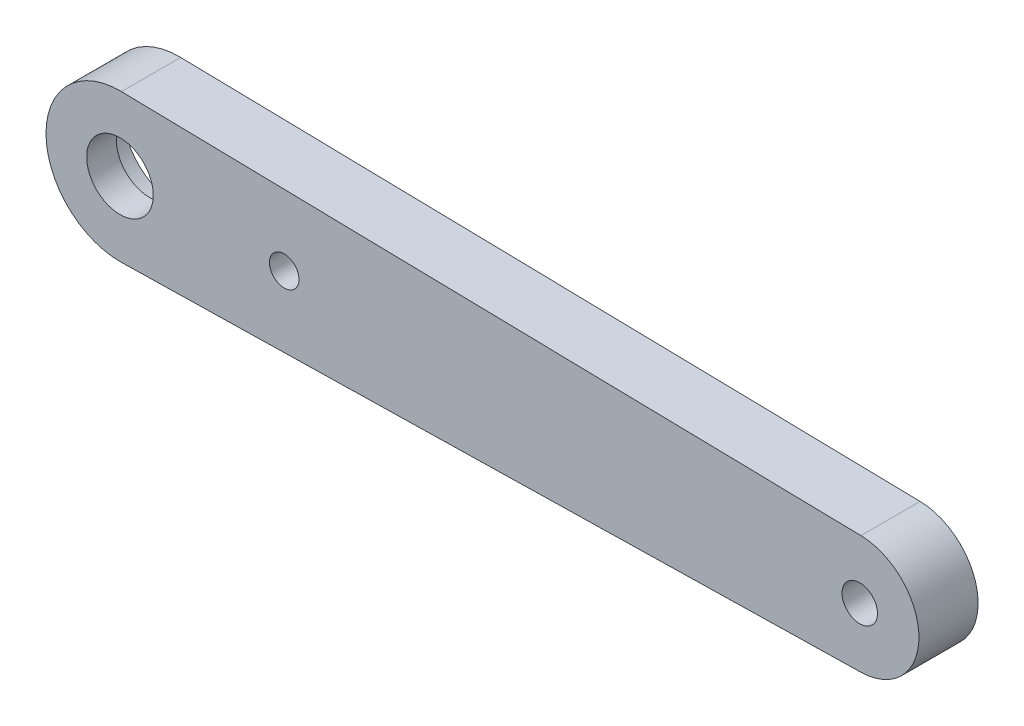
ISO-10303-21;
HEADER;
FILE_DESCRIPTION(('STEP AP214'),'2;1');
FILE_NAME('part.step','',(''),(''),'','','');
FILE_SCHEMA(('AUTOMOTIVE_DESIGN { 1 0 10303 214 1 1 1 1 }'));
ENDSEC;
DATA;
#1=APPLICATION_CONTEXT('core data for automotive mechanical design processes');
#2=APPLICATION_PROTOCOL_DEFINITION('international standard','automotive_design',2000,#1);
#3=PRODUCT_CONTEXT('',#1,'mechanical');
#4=PRODUCT('Part','Part','',(#3));
#5=PRODUCT_RELATED_PRODUCT_CATEGORY('part','',(#4));
#6=PRODUCT_DEFINITION_FORMATION('','',#4);
#7=PRODUCT_DEFINITION_CONTEXT('part definition',#1,'design');
#8=PRODUCT_DEFINITION('design','',#6,#7);
#9=PRODUCT_DEFINITION_SHAPE('','',#8);
#10=(LENGTH_UNIT() NAMED_UNIT(*) SI_UNIT(.MILLI.,.METRE.));
#11=(NAMED_UNIT(*) PLANE_ANGLE_UNIT() SI_UNIT($,.RADIAN.));
#12=(NAMED_UNIT(*) SI_UNIT($,.STERADIAN.) SOLID_ANGLE_UNIT());
#13=UNCERTAINTY_MEASURE_WITH_UNIT(LENGTH_MEASURE(1.E-05),#10,'distance_accuracy_value','');
#14=(GEOMETRIC_REPRESENTATION_CONTEXT(3) GLOBAL_UNCERTAINTY_ASSIGNED_CONTEXT((#13)) GLOBAL_UNIT_ASSIGNED_CONTEXT((#10,
#11,#12)) REPRESENTATION_CONTEXT('',''));
#15=CARTESIAN_POINT('',(0.,0.,0.));
#16=DIRECTION('',(0.,0.,1.));
#17=DIRECTION('',(1.,0.,0.));
#18=AXIS2_PLACEMENT_3D('',#15,#16,#17);
#19=CARTESIAN_POINT('',(0.1,-4.99899989998,4.));
#20=DIRECTION('',(-0.02,0.999799979995999,0.));
#21=DIRECTION('',(-0.999799979995999,-0.02,0.));
#22=AXIS2_PLACEMENT_3D('',#19,#20,#21);
#23=PLANE('',#22);
#24=DIRECTION('',(0.999799979995999,0.02,0.));
#25=VECTOR('',#24,1.);
#26=CARTESIAN_POINT('',(0.1,-4.99899989998,0.));
#27=LINE('',#26,#25);
#28=CARTESIAN_POINT('',(0.1,-4.99899989998,0.));
#29=VERTEX_POINT('',#28);
#30=CARTESIAN_POINT('',(50.08,-3.999199919984,0.));
#31=VERTEX_POINT('',#30);
#32=EDGE_CURVE('E186',#29,#31,#27,.T.);
#33=ORIENTED_EDGE('',*,*,#32,.T.);
#34=DIRECTION('',(0.,0.,-1.));
#35=VECTOR('',#34,1.);
#36=CARTESIAN_POINT('',(50.08,-3.999199919984,4.));
#37=LINE('',#36,#35);
#38=CARTESIAN_POINT('',(50.08,-3.999199919984,4.));
#39=VERTEX_POINT('',#38);
#40=EDGE_CURVE('E11',#39,#31,#37,.T.);
#41=ORIENTED_EDGE('',*,*,#40,.F.);
#42=DIRECTION('',(0.999799979995999,0.02,0.));
#43=VECTOR('',#42,1.);
#44=CARTESIAN_POINT('',(0.1,-4.99899989998,4.));
#45=LINE('',#44,#43);
#46=CARTESIAN_POINT('',(0.1,-4.99899989998,4.));
#47=VERTEX_POINT('',#46);
#48=EDGE_CURVE('E187',#47,#39,#45,.T.);
#49=ORIENTED_EDGE('',*,*,#48,.F.);
#50=DIRECTION('',(0.,0.,-1.));
#51=VECTOR('',#50,1.);
#52=CARTESIAN_POINT('',(0.1,-4.99899989998,4.));
#53=LINE('',#52,#51);
#54=EDGE_CURVE('E198',#47,#29,#53,.T.);
#55=ORIENTED_EDGE('',*,*,#54,.T.);
#56=EDGE_LOOP('',(#33,#41,#49,#55));
#57=FACE_BOUND('',#56,.T.);
#58=ADVANCED_FACE('F41',(#57),#23,.F.);
#59=CARTESIAN_POINT('',(50.,0.,4.));
#60=DIRECTION('',(0.,0.,-1.));
#61=DIRECTION('',(-1.,0.,0.));
#62=AXIS2_PLACEMENT_3D('',#59,#60,#61);
#63=CYLINDRICAL_SURFACE('',#62,4.00000000000001);
#64=CARTESIAN_POINT('',(50.,0.,0.));
#65=DIRECTION('',(0.,0.,1.));
#66=DIRECTION('',(1.,0.,0.));
#67=AXIS2_PLACEMENT_3D('',#64,#65,#66);
#68=CIRCLE('',#67,4.00000000000001);
#69=CARTESIAN_POINT('',(50.08,3.999199919984,0.));
#70=VERTEX_POINT('',#69);
#71=EDGE_CURVE('E201',#31,#70,#68,.T.);
#72=ORIENTED_EDGE('',*,*,#71,.T.);
#73=DIRECTION('',(0.,0.,-1.));
#74=VECTOR('',#73,1.);
#75=CARTESIAN_POINT('',(50.08,3.999199919984,4.));
#76=LINE('',#75,#74);
#77=CARTESIAN_POINT('',(50.08,3.999199919984,4.));
#78=VERTEX_POINT('',#77);
#79=EDGE_CURVE('E49',#78,#70,#76,.T.);
#80=ORIENTED_EDGE('',*,*,#79,.F.);
#81=CARTESIAN_POINT('',(50.,0.,4.));
#82=DIRECTION('',(0.,0.,1.));
#83=DIRECTION('',(1.,0.,0.));
#84=AXIS2_PLACEMENT_3D('',#81,#82,#83);
#85=CIRCLE('',#84,4.00000000000001);
#86=EDGE_CURVE('E93',#39,#78,#85,.T.);
#87=ORIENTED_EDGE('',*,*,#86,.F.);
#88=ORIENTED_EDGE('',*,*,#40,.T.);
#89=EDGE_LOOP('',(#72,#80,#87,#88));
#90=FACE_BOUND('',#89,.T.);
#91=ADVANCED_FACE('F216',(#90),#63,.T.);
#92=CARTESIAN_POINT('',(0.1,4.99899989998,4.));
#93=DIRECTION('',(0.02,0.999799979995999,0.));
#94=DIRECTION('',(-0.999799979995999,0.02,0.));
#95=AXIS2_PLACEMENT_3D('',#92,#93,#94);
#96=PLANE('',#95);
#97=DIRECTION('',(0.999799979995999,-0.02,0.));
#98=VECTOR('',#97,1.);
#99=CARTESIAN_POINT('',(0.1,4.99899989998,0.));
#100=LINE('',#99,#98);
#101=CARTESIAN_POINT('',(0.0999999999999983,4.99899989998,0.));
#102=VERTEX_POINT('',#101);
#103=EDGE_CURVE('E204',#102,#70,#100,.T.);
#104=ORIENTED_EDGE('',*,*,#103,.F.);
#105=DIRECTION('',(0.,0.,-1.));
#106=VECTOR('',#105,1.);
#107=CARTESIAN_POINT('',(0.0999999999999983,4.99899989998,4.));
#108=LINE('',#107,#106);
#109=CARTESIAN_POINT('',(0.0999999999999983,4.99899989998,4.));
#110=VERTEX_POINT('',#109);
#111=EDGE_CURVE('E211',#110,#102,#108,.T.);
#112=ORIENTED_EDGE('',*,*,#111,.F.);
#113=DIRECTION('',(0.999799979995999,-0.02,0.));
#114=VECTOR('',#113,1.);
#115=CARTESIAN_POINT('',(0.1,4.99899989998,4.));
#116=LINE('',#115,#114);
#117=EDGE_CURVE('E191',#110,#78,#116,.T.);
#118=ORIENTED_EDGE('',*,*,#117,.T.);
#119=ORIENTED_EDGE('',*,*,#79,.T.);
#120=EDGE_LOOP('',(#104,#112,#118,#119));
#121=FACE_BOUND('',#120,.T.);
#122=ADVANCED_FACE('F215',(#121),#96,.T.);
#123=CARTESIAN_POINT('',(0.,0.,4.));
#124=DIRECTION('',(0.,0.,-1.));
#125=DIRECTION('',(-1.,0.,0.));
#126=AXIS2_PLACEMENT_3D('',#123,#124,#125);
#127=CYLINDRICAL_SURFACE('',#126,5.);
#128=CARTESIAN_POINT('',(0.,0.,0.));
#129=DIRECTION('',(0.,0.,1.));
#130=DIRECTION('',(1.,0.,0.));
#131=AXIS2_PLACEMENT_3D('',#128,#129,#130);
#132=CIRCLE('',#131,5.);
#133=EDGE_CURVE('E86',#102,#29,#132,.T.);
#134=ORIENTED_EDGE('',*,*,#133,.T.);
#135=ORIENTED_EDGE('',*,*,#54,.F.);
#136=CARTESIAN_POINT('',(0.,0.,4.));
#137=DIRECTION('',(0.,0.,1.));
#138=DIRECTION('',(1.,0.,0.));
#139=AXIS2_PLACEMENT_3D('',#136,#137,#138);
#140=CIRCLE('',#139,5.);
#141=EDGE_CURVE('E65',#110,#47,#140,.T.);
#142=ORIENTED_EDGE('',*,*,#141,.F.);
#143=ORIENTED_EDGE('',*,*,#111,.T.);
#144=EDGE_LOOP('',(#134,#135,#142,#143));
#145=FACE_BOUND('',#144,.T.);
#146=ADVANCED_FACE('F224',(#145),#127,.T.);
#147=CARTESIAN_POINT('',(50.,0.,4.));
#148=DIRECTION('',(0.,0.,-1.));
#149=DIRECTION('',(-1.,0.,0.));
#150=AXIS2_PLACEMENT_3D('',#147,#148,#149);
#151=CYLINDRICAL_SURFACE('',#150,1.2);
#152=CARTESIAN_POINT('',(50.,0.,4.));
#153=DIRECTION('',(0.,0.,1.));
#154=DIRECTION('',(1.,0.,0.));
#155=AXIS2_PLACEMENT_3D('',#152,#153,#154);
#156=CIRCLE('',#155,1.2);
#157=CARTESIAN_POINT('',(51.2,0.,4.));
#158=VERTEX_POINT('',#157);
#159=EDGE_CURVE('E195',#158,#158,#156,.T.);
#160=ORIENTED_EDGE('',*,*,#159,.T.);
#161=EDGE_LOOP('',(#160));
#162=FACE_BOUND('',#161,.T.);
#163=CARTESIAN_POINT('',(50.,0.,0.));
#164=DIRECTION('',(0.,0.,1.));
#165=DIRECTION('',(1.,0.,0.));
#166=AXIS2_PLACEMENT_3D('',#163,#164,#165);
#167=CIRCLE('',#166,1.2);
#168=CARTESIAN_POINT('',(51.2,0.,0.));
#169=VERTEX_POINT('',#168);
#170=EDGE_CURVE('E189',#169,#169,#167,.T.);
#171=ORIENTED_EDGE('',*,*,#170,.F.);
#172=EDGE_LOOP('',(#171));
#173=FACE_BOUND('',#172,.T.);
#174=ADVANCED_FACE('F228',(#162,#173),#151,.F.);
#175=CARTESIAN_POINT('',(0.,0.,4.));
#176=DIRECTION('',(0.,0.,1.));
#177=DIRECTION('',(1.,0.,0.));
#178=AXIS2_PLACEMENT_3D('',#175,#176,#177);
#179=PLANE('',#178);
#180=CARTESIAN_POINT('',(-3.0739299994309E-12,1.05644659686988E-12,4.));
#181=DIRECTION('',(0.,0.,1.));
#182=DIRECTION('',(1.,0.,0.));
#183=AXIS2_PLACEMENT_3D('',#180,#181,#182);
#184=CIRCLE('',#183,2.25000000000266);
#185=CARTESIAN_POINT('',(2.24999999999959,1.05644659686988E-12,4.));
#186=VERTEX_POINT('',#185);
#187=EDGE_CURVE('E452',#186,#186,#184,.T.);
#188=ORIENTED_EDGE('',*,*,#187,.F.);
#189=EDGE_LOOP('',(#188));
#190=FACE_BOUND('',#189,.T.);
#191=CARTESIAN_POINT('',(11.1,0.,4.));
#192=DIRECTION('',(0.,0.,1.));
#193=DIRECTION('',(1.,0.,0.));
#194=AXIS2_PLACEMENT_3D('',#191,#192,#193);
#195=CIRCLE('',#194,1.);
#196=CARTESIAN_POINT('',(12.1,0.,4.));
#197=VERTEX_POINT('',#196);
#198=EDGE_CURVE('E158',#197,#197,#195,.T.);
#199=ORIENTED_EDGE('',*,*,#198,.F.);
#200=EDGE_LOOP('',(#199));
#201=FACE_BOUND('',#200,.T.);
#202=ORIENTED_EDGE('',*,*,#48,.T.);
#203=ORIENTED_EDGE('',*,*,#86,.T.);
#204=ORIENTED_EDGE('',*,*,#117,.F.);
#205=ORIENTED_EDGE('',*,*,#141,.T.);
#206=EDGE_LOOP('',(#202,#203,#204,#205));
#207=FACE_BOUND('',#206,.T.);
#208=ORIENTED_EDGE('',*,*,#159,.F.);
#209=EDGE_LOOP('',(#208));
#210=FACE_BOUND('',#209,.T.);
#211=ADVANCED_FACE('F225',(#190,#201,#207,#210),#179,.T.);
#212=CARTESIAN_POINT('',(0.,0.,0.));
#213=DIRECTION('',(0.,0.,1.));
#214=DIRECTION('',(1.,0.,0.));
#215=AXIS2_PLACEMENT_3D('',#212,#213,#214);
#216=PLANE('',#215);
#217=CARTESIAN_POINT('',(0.,0.,0.));
#218=DIRECTION('',(0.,0.,1.));
#219=DIRECTION('',(1.,0.,0.));
#220=AXIS2_PLACEMENT_3D('',#217,#218,#219);
#221=CIRCLE('',#220,3.85);
#222=CARTESIAN_POINT('',(0.363207547169811,-3.83282927844157,0.));
#223=VERTEX_POINT('',#222);
#224=CARTESIAN_POINT('',(0.363207547169811,3.83282927844157,0.));
#225=VERTEX_POINT('',#224);
#226=EDGE_CURVE('E180',#223,#225,#221,.F.);
#227=ORIENTED_EDGE('',*,*,#226,.F.);
#228=DIRECTION('',(-0.995540072322485,-0.0943396226415095,0.));
#229=VECTOR('',#228,1.);
#230=CARTESIAN_POINT('',(0.363207547169812,-3.83282927844157,0.));
#231=LINE('',#230,#229);
#232=CARTESIAN_POINT('',(16.1216981132075,-2.33951916995784,0.));
#233=VERTEX_POINT('',#232);
#234=EDGE_CURVE('E136',#233,#223,#231,.T.);
#235=ORIENTED_EDGE('',*,*,#234,.F.);
#236=CARTESIAN_POINT('',(15.9,0.,0.));
#237=DIRECTION('',(0.,0.,1.));
#238=DIRECTION('',(1.,0.,0.));
#239=AXIS2_PLACEMENT_3D('',#236,#237,#238);
#240=CIRCLE('',#239,2.35);
#241=CARTESIAN_POINT('',(16.1216981132075,2.33951916995784,0.));
#242=VERTEX_POINT('',#241);
#243=EDGE_CURVE('E182',#242,#233,#240,.F.);
#244=ORIENTED_EDGE('',*,*,#243,.F.);
#245=DIRECTION('',(-0.995540072322485,0.0943396226415095,0.));
#246=VECTOR('',#245,1.);
#247=CARTESIAN_POINT('',(0.363207547169812,3.83282927844157,0.));
#248=LINE('',#247,#246);
#249=EDGE_CURVE('E139',#242,#225,#248,.T.);
#250=ORIENTED_EDGE('',*,*,#249,.T.);
#251=EDGE_LOOP('',(#227,#235,#244,#250));
#252=FACE_BOUND('',#251,.T.);
#253=ORIENTED_EDGE('',*,*,#32,.F.);
#254=ORIENTED_EDGE('',*,*,#133,.F.);
#255=ORIENTED_EDGE('',*,*,#103,.T.);
#256=ORIENTED_EDGE('',*,*,#71,.F.);
#257=EDGE_LOOP('',(#253,#254,#255,#256));
#258=FACE_BOUND('',#257,.T.);
#259=ORIENTED_EDGE('',*,*,#170,.T.);
#260=EDGE_LOOP('',(#259));
#261=FACE_BOUND('',#260,.T.);
#262=ADVANCED_FACE('F220',(#252,#258,#261),#216,.F.);
#263=CARTESIAN_POINT('',(0.363207547169812,-3.83282927844157,-23.4029912618024));
#264=DIRECTION('',(0.0943396226415095,-0.995540072322485,0.));
#265=DIRECTION('',(0.995540072322485,0.0943396226415095,0.));
#266=AXIS2_PLACEMENT_3D('',#263,#264,#265);
#267=PLANE('',#266);
#268=ORIENTED_EDGE('',*,*,#234,.T.);
#269=DIRECTION('',(0.,0.,1.));
#270=VECTOR('',#269,1.);
#271=CARTESIAN_POINT('',(0.363207547169811,-3.83282927844157,-23.4029912618024));
#272=LINE('',#271,#270);
#273=CARTESIAN_POINT('',(0.363207547169812,-3.83282927844157,2.));
#274=VERTEX_POINT('',#273);
#275=EDGE_CURVE('E128',#223,#274,#272,.T.);
#276=ORIENTED_EDGE('',*,*,#275,.T.);
#277=DIRECTION('',(-0.995540072322485,-0.0943396226415095,0.));
#278=VECTOR('',#277,1.);
#279=CARTESIAN_POINT('',(0.363207547169812,-3.83282927844157,2.));
#280=LINE('',#279,#278);
#281=CARTESIAN_POINT('',(6.,-3.29867411212271,2.));
#282=VERTEX_POINT('',#281);
#283=EDGE_CURVE('E132',#282,#274,#280,.T.);
#284=ORIENTED_EDGE('',*,*,#283,.F.);
#285=DIRECTION('',(0.,0.,-1.));
#286=VECTOR('',#285,1.);
#287=CARTESIAN_POINT('',(6.,-3.29867411212271,2.));
#288=LINE('',#287,#286);
#289=CARTESIAN_POINT('',(6.,-3.29867411212271,1.5));
#290=VERTEX_POINT('',#289);
#291=EDGE_CURVE('E166',#282,#290,#288,.T.);
#292=ORIENTED_EDGE('',*,*,#291,.T.);
#293=DIRECTION('',(0.995540072322485,0.0943396226415095,0.));
#294=VECTOR('',#293,1.);
#295=CARTESIAN_POINT('',(0.363207547169812,-3.83282927844157,1.5));
#296=LINE('',#295,#294);
#297=CARTESIAN_POINT('',(16.1216981132075,-2.33951916995784,1.5));
#298=VERTEX_POINT('',#297);
#299=EDGE_CURVE('E173',#290,#298,#296,.T.);
#300=ORIENTED_EDGE('',*,*,#299,.T.);
#301=DIRECTION('',(0.,0.,1.));
#302=VECTOR('',#301,1.);
#303=CARTESIAN_POINT('',(16.1216981132075,-2.33951916995784,-23.4029912618024));
#304=LINE('',#303,#302);
#305=EDGE_CURVE('E140',#233,#298,#304,.T.);
#306=ORIENTED_EDGE('',*,*,#305,.F.);
#307=EDGE_LOOP('',(#268,#276,#284,#292,#300,#306));
#308=FACE_BOUND('',#307,.T.);
#309=ADVANCED_FACE('F130',(#308),#267,.F.);
#310=CARTESIAN_POINT('',(0.,0.,-23.4029912618024));
#311=DIRECTION('',(0.,0.,1.));
#312=DIRECTION('',(1.,0.,0.));
#313=AXIS2_PLACEMENT_3D('',#310,#311,#312);
#314=CYLINDRICAL_SURFACE('',#313,3.85);
#315=ORIENTED_EDGE('',*,*,#226,.T.);
#316=DIRECTION('',(0.,0.,1.));
#317=VECTOR('',#316,1.);
#318=CARTESIAN_POINT('',(0.363207547169811,3.83282927844157,-23.4029912618024));
#319=LINE('',#318,#317);
#320=CARTESIAN_POINT('',(0.363207547169811,3.83282927844157,2.));
#321=VERTEX_POINT('',#320);
#322=EDGE_CURVE('E146',#225,#321,#319,.T.);
#323=ORIENTED_EDGE('',*,*,#322,.T.);
#324=CARTESIAN_POINT('',(0.,0.,2.));
#325=DIRECTION('',(0.,0.,-1.));
#326=DIRECTION('',(-1.,0.,0.));
#327=AXIS2_PLACEMENT_3D('',#324,#325,#326);
#328=CIRCLE('',#327,3.85);
#329=EDGE_CURVE('E143',#274,#321,#328,.T.);
#330=ORIENTED_EDGE('',*,*,#329,.F.);
#331=ORIENTED_EDGE('',*,*,#275,.F.);
#332=EDGE_LOOP('',(#315,#323,#330,#331));
#333=FACE_BOUND('',#332,.T.);
#334=ADVANCED_FACE('F144',(#333),#314,.F.);
#335=CARTESIAN_POINT('',(0.363207547169812,3.83282927844157,-23.4029912618024));
#336=DIRECTION('',(-0.0943396226415095,-0.995540072322485,0.));
#337=DIRECTION('',(0.995540072322485,-0.0943396226415095,0.));
#338=AXIS2_PLACEMENT_3D('',#335,#336,#337);
#339=PLANE('',#338);
#340=DIRECTION('',(0.,0.,1.));
#341=VECTOR('',#340,1.);
#342=CARTESIAN_POINT('',(16.1216981132075,2.33951916995784,-23.4029912618024));
#343=LINE('',#342,#341);
#344=CARTESIAN_POINT('',(16.1216981132075,2.33951916995784,1.5));
#345=VERTEX_POINT('',#344);
#346=EDGE_CURVE('E56',#242,#345,#343,.T.);
#347=ORIENTED_EDGE('',*,*,#346,.T.);
#348=DIRECTION('',(0.995540072322485,-0.0943396226415095,0.));
#349=VECTOR('',#348,1.);
#350=CARTESIAN_POINT('',(0.363207547169812,3.83282927844157,1.5));
#351=LINE('',#350,#349);
#352=CARTESIAN_POINT('',(6.,3.2986741121227,1.5));
#353=VERTEX_POINT('',#352);
#354=EDGE_CURVE('E169',#353,#345,#351,.T.);
#355=ORIENTED_EDGE('',*,*,#354,.F.);
#356=DIRECTION('',(0.,0.,-1.));
#357=VECTOR('',#356,1.);
#358=CARTESIAN_POINT('',(6.,3.2986741121227,2.));
#359=LINE('',#358,#357);
#360=CARTESIAN_POINT('',(6.,3.2986741121227,2.));
#361=VERTEX_POINT('',#360);
#362=EDGE_CURVE('E164',#361,#353,#359,.T.);
#363=ORIENTED_EDGE('',*,*,#362,.F.);
#364=DIRECTION('',(0.995540072322485,-0.0943396226415095,0.));
#365=VECTOR('',#364,1.);
#366=CARTESIAN_POINT('',(0.363207547169812,3.83282927844157,2.));
#367=LINE('',#366,#365);
#368=EDGE_CURVE('E150',#321,#361,#367,.T.);
#369=ORIENTED_EDGE('',*,*,#368,.F.);
#370=ORIENTED_EDGE('',*,*,#322,.F.);
#371=ORIENTED_EDGE('',*,*,#249,.F.);
#372=EDGE_LOOP('',(#347,#355,#363,#369,#370,#371));
#373=FACE_BOUND('',#372,.T.);
#374=ADVANCED_FACE('F316',(#373),#339,.T.);
#375=CARTESIAN_POINT('',(15.9,0.,-23.4029912618024));
#376=DIRECTION('',(0.,0.,1.));
#377=DIRECTION('',(1.,0.,0.));
#378=AXIS2_PLACEMENT_3D('',#375,#376,#377);
#379=CYLINDRICAL_SURFACE('',#378,2.35);
#380=ORIENTED_EDGE('',*,*,#243,.T.);
#381=ORIENTED_EDGE('',*,*,#305,.T.);
#382=CARTESIAN_POINT('',(15.9,0.,1.5));
#383=DIRECTION('',(0.,0.,1.));
#384=DIRECTION('',(1.,0.,0.));
#385=AXIS2_PLACEMENT_3D('',#382,#383,#384);
#386=CIRCLE('',#385,2.35);
#387=EDGE_CURVE('E171',#298,#345,#386,.T.);
#388=ORIENTED_EDGE('',*,*,#387,.T.);
#389=ORIENTED_EDGE('',*,*,#346,.F.);
#390=EDGE_LOOP('',(#380,#381,#388,#389));
#391=FACE_BOUND('',#390,.T.);
#392=ADVANCED_FACE('F312',(#391),#379,.F.);
#393=CARTESIAN_POINT('',(0.,0.,1.5));
#394=DIRECTION('',(0.,0.,1.));
#395=DIRECTION('',(1.,0.,0.));
#396=AXIS2_PLACEMENT_3D('',#393,#394,#395);
#397=PLANE('',#396);
#398=CARTESIAN_POINT('',(11.1,0.,1.5));
#399=DIRECTION('',(0.,0.,-1.));
#400=DIRECTION('',(-1.,0.,0.));
#401=AXIS2_PLACEMENT_3D('',#398,#399,#400);
#402=CIRCLE('',#401,1.);
#403=CARTESIAN_POINT('',(10.1,0.,1.5));
#404=VERTEX_POINT('',#403);
#405=EDGE_CURVE('E450',#404,#404,#402,.T.);
#406=ORIENTED_EDGE('',*,*,#405,.F.);
#407=EDGE_LOOP('',(#406));
#408=FACE_BOUND('',#407,.T.);
#409=ORIENTED_EDGE('',*,*,#299,.F.);
#410=DIRECTION('',(0.,-1.,0.));
#411=VECTOR('',#410,1.);
#412=CARTESIAN_POINT('',(6.,0.,1.5));
#413=LINE('',#412,#411);
#414=EDGE_CURVE('E155',#353,#290,#413,.T.);
#415=ORIENTED_EDGE('',*,*,#414,.F.);
#416=ORIENTED_EDGE('',*,*,#354,.T.);
#417=ORIENTED_EDGE('',*,*,#387,.F.);
#418=EDGE_LOOP('',(#409,#415,#416,#417));
#419=FACE_BOUND('',#418,.T.);
#420=ADVANCED_FACE('F308',(#408,#419),#397,.F.);
#421=CARTESIAN_POINT('',(6.,0.,2.));
#422=DIRECTION('',(1.,0.,0.));
#423=DIRECTION('',(0.,1.,0.));
#424=AXIS2_PLACEMENT_3D('',#421,#422,#423);
#425=PLANE('',#424);
#426=ORIENTED_EDGE('',*,*,#414,.T.);
#427=ORIENTED_EDGE('',*,*,#291,.F.);
#428=DIRECTION('',(0.,-1.,0.));
#429=VECTOR('',#428,1.);
#430=CARTESIAN_POINT('',(6.,0.,2.));
#431=LINE('',#430,#429);
#432=EDGE_CURVE('E154',#361,#282,#431,.T.);
#433=ORIENTED_EDGE('',*,*,#432,.F.);
#434=ORIENTED_EDGE('',*,*,#362,.T.);
#435=EDGE_LOOP('',(#426,#427,#433,#434));
#436=FACE_BOUND('',#435,.T.);
#437=ADVANCED_FACE('F283',(#436),#425,.F.);
#438=CARTESIAN_POINT('',(0.,0.,2.));
#439=DIRECTION('',(0.,0.,-1.));
#440=DIRECTION('',(-1.,0.,0.));
#441=AXIS2_PLACEMENT_3D('',#438,#439,#440);
#442=PLANE('',#441);
#443=CARTESIAN_POINT('',(-3.0739299994309E-12,1.05644659686988E-12,2.));
#444=DIRECTION('',(0.,0.,-1.));
#445=DIRECTION('',(-1.,0.,0.));
#446=AXIS2_PLACEMENT_3D('',#443,#444,#445);
#447=CIRCLE('',#446,2.25000000000266);
#448=CARTESIAN_POINT('',(-2.25000000000573,1.05644659686988E-12,2.));
#449=VERTEX_POINT('',#448);
#450=EDGE_CURVE('E44',#449,#449,#447,.T.);
#451=ORIENTED_EDGE('',*,*,#450,.F.);
#452=EDGE_LOOP('',(#451));
#453=FACE_BOUND('',#452,.T.);
#454=ORIENTED_EDGE('',*,*,#283,.T.);
#455=ORIENTED_EDGE('',*,*,#329,.T.);
#456=ORIENTED_EDGE('',*,*,#368,.T.);
#457=ORIENTED_EDGE('',*,*,#432,.T.);
#458=EDGE_LOOP('',(#454,#455,#456,#457));
#459=FACE_BOUND('',#458,.T.);
#460=ADVANCED_FACE('F152',(#453,#459),#442,.T.);
#461=CARTESIAN_POINT('',(11.1,0.,7.5));
#462=DIRECTION('',(0.,0.,-1.));
#463=DIRECTION('',(-1.,0.,0.));
#464=AXIS2_PLACEMENT_3D('',#461,#462,#463);
#465=CYLINDRICAL_SURFACE('',#464,1.);
#466=ORIENTED_EDGE('',*,*,#198,.T.);
#467=EDGE_LOOP('',(#466));
#468=FACE_BOUND('',#467,.T.);
#469=ORIENTED_EDGE('',*,*,#405,.T.);
#470=EDGE_LOOP('',(#469));
#471=FACE_BOUND('',#470,.T.);
#472=ADVANCED_FACE('F274',(#468,#471),#465,.F.);
#473=CARTESIAN_POINT('',(-3.0739299994309E-12,1.05644659686988E-12,-6.));
#474=DIRECTION('',(0.,0.,1.));
#475=DIRECTION('',(1.,0.,0.));
#476=AXIS2_PLACEMENT_3D('',#473,#474,#475);
#477=CYLINDRICAL_SURFACE('',#476,2.25000000000266);
#478=ORIENTED_EDGE('',*,*,#450,.T.);
#479=EDGE_LOOP('',(#478));
#480=FACE_BOUND('',#479,.T.);
#481=ORIENTED_EDGE('',*,*,#187,.T.);
#482=EDGE_LOOP('',(#481));
#483=FACE_BOUND('',#482,.T.);
#484=ADVANCED_FACE('F291',(#480,#483),#477,.F.);
#485=CLOSED_SHELL('',(#58,#91,#122,#146,#174,#211,#262,#309,#334,#374,#392,#420,#437,#460,#472,#484));
#486=MANIFOLD_SOLID_BREP('B2',#485);
#487=ADVANCED_BREP_SHAPE_REPRESENTATION('',(#18,#486),#14);
#488=SHAPE_DEFINITION_REPRESENTATION(#9,#487);
ENDSEC;
END-ISO-10303-21;
